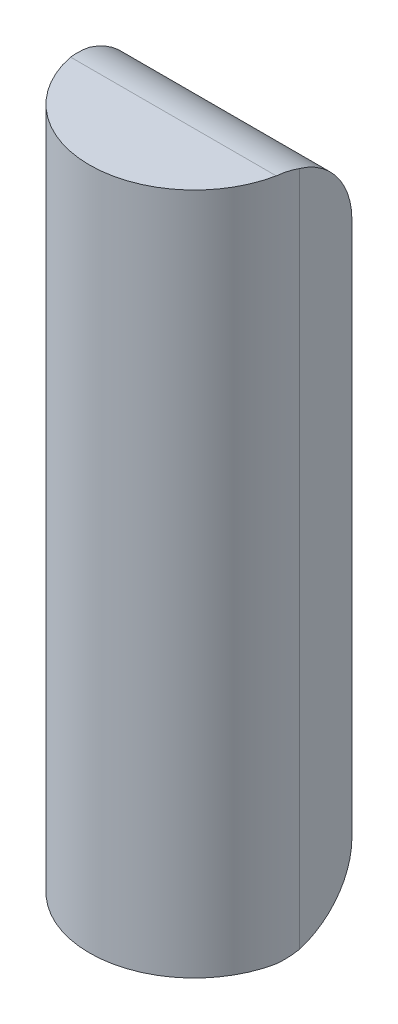
ISO-10303-21;
HEADER;
FILE_DESCRIPTION(('STEP AP214'),'2;1');
FILE_NAME('part.step','',(''),(''),'','','');
FILE_SCHEMA(('AUTOMOTIVE_DESIGN { 1 0 10303 214 1 1 1 1 }'));
ENDSEC;
DATA;
#1=APPLICATION_CONTEXT('core data for automotive mechanical design processes');
#2=APPLICATION_PROTOCOL_DEFINITION('international standard','automotive_design',2000,#1);
#3=PRODUCT_CONTEXT('',#1,'mechanical');
#4=PRODUCT('Part','Part','',(#3));
#5=PRODUCT_RELATED_PRODUCT_CATEGORY('part','',(#4));
#6=PRODUCT_DEFINITION_FORMATION('','',#4);
#7=PRODUCT_DEFINITION_CONTEXT('part definition',#1,'design');
#8=PRODUCT_DEFINITION('design','',#6,#7);
#9=PRODUCT_DEFINITION_SHAPE('','',#8);
#10=(LENGTH_UNIT() NAMED_UNIT(*) SI_UNIT(.MILLI.,.METRE.));
#11=(NAMED_UNIT(*) PLANE_ANGLE_UNIT() SI_UNIT($,.RADIAN.));
#12=(NAMED_UNIT(*) SI_UNIT($,.STERADIAN.) SOLID_ANGLE_UNIT());
#13=UNCERTAINTY_MEASURE_WITH_UNIT(LENGTH_MEASURE(1.E-05),#10,'distance_accuracy_value','');
#14=(GEOMETRIC_REPRESENTATION_CONTEXT(3) GLOBAL_UNCERTAINTY_ASSIGNED_CONTEXT((#13)) GLOBAL_UNIT_ASSIGNED_CONTEXT((#10,
#11,#12)) REPRESENTATION_CONTEXT('',''));
#15=CARTESIAN_POINT('',(0.,0.,0.));
#16=DIRECTION('',(0.,0.,1.));
#17=DIRECTION('',(1.,0.,0.));
#18=AXIS2_PLACEMENT_3D('',#15,#16,#17);
#19=CARTESIAN_POINT('',(0.2,0.,-0.35));
#20=DIRECTION('',(0.,1.,0.));
#21=DIRECTION('',(0.,0.,1.));
#22=AXIS2_PLACEMENT_3D('',#19,#20,#21);
#23=CYLINDRICAL_SURFACE('',#22,0.1);
#24=CARTESIAN_POINT('',(0.2,0.,-0.35));
#25=DIRECTION('',(0.,1.,0.));
#26=DIRECTION('',(0.,0.,1.));
#27=AXIS2_PLACEMENT_3D('',#24,#25,#26);
#28=CIRCLE('',#27,0.1);
#29=CARTESIAN_POINT('',(0.102020410288673,0.,-0.33));
#30=VERTEX_POINT('',#29);
#31=CARTESIAN_POINT('',(0.297979589711328,0.,-0.33));
#32=VERTEX_POINT('',#31);
#33=EDGE_CURVE('E11',#30,#32,#28,.T.);
#34=ORIENTED_EDGE('',*,*,#33,.T.);
#35=CARTESIAN_POINT('',(0.3,0.00291796067500543,-0.349999999999997));
#36=CARTESIAN_POINT('',(0.299915816237972,0.00267649394960228,-0.349190121189793));
#37=CARTESIAN_POINT('',(0.299831632475944,0.00244970743001091,-0.348375866058584));
#38=CARTESIAN_POINT('',(0.299663264951888,0.00202576163123392,-0.34673967912913));
#39=CARTESIAN_POINT('',(0.29957908118986,0.00182860235204831,-0.345917747330885));
#40=CARTESIAN_POINT('',(0.299410713665804,0.00146417786286507,-0.344267283042332));
#41=CARTESIAN_POINT('',(0.299326529903776,0.00129691265286744,-0.343438750552023));
#42=CARTESIAN_POINT('',(0.29915816237972,0.000992493455461802,-0.341776172212152));
#43=CARTESIAN_POINT('',(0.299073978617692,0.000855339468053788,-0.340942126362589));
#44=CARTESIAN_POINT('',(0.298905611093636,0.000611323369011899,-0.339269615138349));
#45=CARTESIAN_POINT('',(0.298821427331608,0.000504461257378025,-0.338431149763672));
#46=CARTESIAN_POINT('',(0.298653059807552,0.000321168311295574,-0.336750899341898));
#47=CARTESIAN_POINT('',(0.298568876045524,0.000244737476846995,-0.3359091142948));
#48=CARTESIAN_POINT('',(0.298400508521468,0.000122409650322964,-0.334223328579187));
#49=CARTESIAN_POINT('',(0.29831632475944,7.65126582475135E-05,-0.333379327910672));
#50=CARTESIAN_POINT('',(0.298147957235384,1.53042319068262E-05,-0.331690218311812));
#51=CARTESIAN_POINT('',(0.298063773473356,-7.20235841054829E-09,-0.330845109381467));
#52=CARTESIAN_POINT('',(0.297979589711328,0.,-0.33));
#53=B_SPLINE_CURVE_WITH_KNOTS('',3,(#35,#36,#37,#38,#39,#40,#41,#42,#43,#44,#45,#46,#47,#48,#49,
#50,#51,#52),.UNSPECIFIED.,.F.,.F.,(4,2,2,2,2,2,2,2,4),(0.,0.00254773712594258,
0.0050954742518852,0.00764321137782779,0.0101909485037704,0.012738685629713,0.0152864227556555,
0.0178341598815981,0.0203818970075407),.UNSPECIFIED.);
#54=CARTESIAN_POINT('',(0.3,0.00291796067500625,-0.35));
#55=VERTEX_POINT('',#54);
#56=EDGE_CURVE('E25',#55,#32,#53,.T.);
#57=ORIENTED_EDGE('',*,*,#56,.F.);
#58=DIRECTION('',(0.,1.,0.));
#59=VECTOR('',#58,1.);
#60=CARTESIAN_POINT('',(0.3,0.,-0.35));
#61=LINE('',#60,#59);
#62=CARTESIAN_POINT('',(0.3,0.647082039324994,-0.35));
#63=VERTEX_POINT('',#62);
#64=EDGE_CURVE('E73',#55,#63,#61,.T.);
#65=ORIENTED_EDGE('',*,*,#64,.T.);
#66=CARTESIAN_POINT('',(0.297979589711328,0.65,-0.33));
#67=CARTESIAN_POINT('',(0.298063773473356,0.650000007202358,-0.330845109381467));
#68=CARTESIAN_POINT('',(0.298147957235384,0.649984695768093,-0.331690218311812));
#69=CARTESIAN_POINT('',(0.29831632475944,0.649923487341753,-0.333379327910672));
#70=CARTESIAN_POINT('',(0.298400508521468,0.649877590349677,-0.334223328579187));
#71=CARTESIAN_POINT('',(0.298568876045524,0.649755262523153,-0.3359091142948));
#72=CARTESIAN_POINT('',(0.298653059807552,0.649678831688704,-0.336750899341898));
#73=CARTESIAN_POINT('',(0.298821427331608,0.649495538742622,-0.338431149763672));
#74=CARTESIAN_POINT('',(0.298905611093636,0.649388676630988,-0.339269615138349));
#75=CARTESIAN_POINT('',(0.299073978617692,0.649144660531946,-0.340942126362589));
#76=CARTESIAN_POINT('',(0.29915816237972,0.649007506544538,-0.341776172212152));
#77=CARTESIAN_POINT('',(0.299326529903776,0.648703087347132,-0.343438750552023));
#78=CARTESIAN_POINT('',(0.299410713665804,0.648535822137135,-0.344267283042332));
#79=CARTESIAN_POINT('',(0.29957908118986,0.648171397647952,-0.345917747330885));
#80=CARTESIAN_POINT('',(0.299663264951888,0.647974238368766,-0.34673967912913));
#81=CARTESIAN_POINT('',(0.299831632475944,0.647550292569989,-0.348375866058584));
#82=CARTESIAN_POINT('',(0.299915816237972,0.647323506050398,-0.349190121189793));
#83=CARTESIAN_POINT('',(0.3,0.647082039324995,-0.349999999999997));
#84=B_SPLINE_CURVE_WITH_KNOTS('',3,(#66,#67,#68,#69,#70,#71,#72,#73,#74,#75,#76,#77,#78,#79,#80,
#81,#82,#83),.UNSPECIFIED.,.F.,.F.,(4,2,2,2,2,2,2,2,4),(0.,0.0025477371259426,
0.00509547425188517,0.00764321137782782,0.0101909485037704,0.012738685629713,0.0152864227556557,
0.0178341598815982,0.0203818970075409),.UNSPECIFIED.);
#85=CARTESIAN_POINT('',(0.297979589711328,0.65,-0.33));
#86=VERTEX_POINT('',#85);
#87=EDGE_CURVE('E198',#86,#63,#84,.T.);
#88=ORIENTED_EDGE('',*,*,#87,.F.);
#89=CARTESIAN_POINT('',(0.2,0.65,-0.35));
#90=DIRECTION('',(0.,1.,0.));
#91=DIRECTION('',(0.,0.,1.));
#92=AXIS2_PLACEMENT_3D('',#89,#90,#91);
#93=CIRCLE('',#92,0.1);
#94=CARTESIAN_POINT('',(0.102020410288673,0.65,-0.33));
#95=VERTEX_POINT('',#94);
#96=EDGE_CURVE('E208',#95,#86,#93,.T.);
#97=ORIENTED_EDGE('',*,*,#96,.F.);
#98=CARTESIAN_POINT('',(0.1,0.647082039324995,-0.349999999999997));
#99=CARTESIAN_POINT('',(0.100084183762028,0.647323506050398,-0.349190121189793));
#100=CARTESIAN_POINT('',(0.100168367524056,0.647550292569989,-0.348375866058584));
#101=CARTESIAN_POINT('',(0.100336735048112,0.647974238368766,-0.34673967912913));
#102=CARTESIAN_POINT('',(0.10042091881014,0.648171397647952,-0.345917747330885));
#103=CARTESIAN_POINT('',(0.100589286334196,0.648535822137135,-0.344267283042332));
#104=CARTESIAN_POINT('',(0.100673470096224,0.648703087347132,-0.343438750552023));
#105=CARTESIAN_POINT('',(0.10084183762028,0.649007506544538,-0.341776172212152));
#106=CARTESIAN_POINT('',(0.100926021382308,0.649144660531946,-0.340942126362589));
#107=CARTESIAN_POINT('',(0.101094388906365,0.649388676630988,-0.339269615138349));
#108=CARTESIAN_POINT('',(0.101178572668393,0.649495538742622,-0.338431149763672));
#109=CARTESIAN_POINT('',(0.101346940192449,0.649678831688704,-0.336750899341898));
#110=CARTESIAN_POINT('',(0.101431123954477,0.649755262523153,-0.3359091142948));
#111=CARTESIAN_POINT('',(0.101599491478533,0.649877590349677,-0.334223328579187));
#112=CARTESIAN_POINT('',(0.101683675240561,0.649923487341753,-0.333379327910672));
#113=CARTESIAN_POINT('',(0.101852042764617,0.649984695768093,-0.331690218311812));
#114=CARTESIAN_POINT('',(0.101936226526645,0.650000007202358,-0.330845109381467));
#115=CARTESIAN_POINT('',(0.102020410288673,0.65,-0.33));
#116=B_SPLINE_CURVE_WITH_KNOTS('',3,(#98,#99,#100,#101,#102,#103,#104,#105,#106,#107,#108,#109,
#110,#111,#112,#113,#114,#115),.UNSPECIFIED.,.F.,.F.,(4,2,2,2,2,2,2,2,4),(0.,0.0025477371259426,
0.0050954742518852,0.0076432113778277,0.0101909485037703,0.0127386856297129,0.0152864227556554,
0.0178341598815981,0.0203818970075407),.UNSPECIFIED.);
#117=CARTESIAN_POINT('',(0.1,0.647082039324994,-0.35));
#118=VERTEX_POINT('',#117);
#119=EDGE_CURVE('E210',#118,#95,#116,.T.);
#120=ORIENTED_EDGE('',*,*,#119,.F.);
#121=DIRECTION('',(0.,1.,0.));
#122=VECTOR('',#121,1.);
#123=CARTESIAN_POINT('',(0.1,0.,-0.35));
#124=LINE('',#123,#122);
#125=CARTESIAN_POINT('',(0.0999999999999997,0.0029179606750054,-0.349999999999999));
#126=VERTEX_POINT('',#125);
#127=EDGE_CURVE('E214',#126,#118,#124,.T.);
#128=ORIENTED_EDGE('',*,*,#127,.F.);
#129=CARTESIAN_POINT('',(0.102020410288673,0.,-0.33));
#130=CARTESIAN_POINT('',(0.101936226526645,-7.20235841423512E-09,-0.330845109381467));
#131=CARTESIAN_POINT('',(0.101852042764617,1.53042319068252E-05,-0.331690218311812));
#132=CARTESIAN_POINT('',(0.101683675240561,7.65126582475138E-05,-0.333379327910672));
#133=CARTESIAN_POINT('',(0.101599491478533,0.000122409650322963,-0.334223328579187));
#134=CARTESIAN_POINT('',(0.101431123954477,0.000244737476846975,-0.335909114294799));
#135=CARTESIAN_POINT('',(0.101346940192449,0.000321168311295538,-0.336750899341897));
#136=CARTESIAN_POINT('',(0.101178572668393,0.000504461257377977,-0.338431149763672));
#137=CARTESIAN_POINT('',(0.101094388906365,0.000611323369011852,-0.339269615138349));
#138=CARTESIAN_POINT('',(0.100926021382308,0.000855339468053721,-0.340942126362589));
#139=CARTESIAN_POINT('',(0.10084183762028,0.000992493455461713,-0.341776172212152));
#140=CARTESIAN_POINT('',(0.100673470096224,0.00129691265286732,-0.343438750552023));
#141=CARTESIAN_POINT('',(0.100589286334196,0.00146417786286494,-0.344267283042331));
#142=CARTESIAN_POINT('',(0.10042091881014,0.00182860235204814,-0.345917747330884));
#143=CARTESIAN_POINT('',(0.100336735048112,0.00202576163123373,-0.346739679129129));
#144=CARTESIAN_POINT('',(0.100168367524056,0.00244970743001067,-0.348375866058583));
#145=CARTESIAN_POINT('',(0.100084183762028,0.00267649394960202,-0.349190121189792));
#146=CARTESIAN_POINT('',(0.1,0.00291796067500515,-0.349999999999996));
#147=B_SPLINE_CURVE_WITH_KNOTS('',3,(#129,#130,#131,#132,#133,#134,#135,#136,#137,#138,#139,
#140,#141,#142,#143,#144,#145,#146),.UNSPECIFIED.,.F.,.F.,(4,2,2,2,2,2,2,2,4),(0.,
0.00254773712594245,0.00509547425188487,0.00764321137782737,0.0101909485037699,
0.0127386856297124,0.0152864227556549,0.0178341598815973,0.0203818970075397),.UNSPECIFIED.);
#148=EDGE_CURVE('E117',#30,#126,#147,.T.);
#149=ORIENTED_EDGE('',*,*,#148,.F.);
#150=EDGE_LOOP('',(#34,#57,#65,#88,#97,#120,#128,#149));
#151=FACE_BOUND('',#150,.T.);
#152=ADVANCED_FACE('F17',(#151),#23,.T.);
#153=CARTESIAN_POINT('',(0.1,0.,-0.4));
#154=DIRECTION('',(-1.,0.,0.));
#155=DIRECTION('',(0.,0.,1.));
#156=AXIS2_PLACEMENT_3D('',#153,#154,#155);
#157=PLANE('',#156);
#158=CARTESIAN_POINT('',(0.1,0.58,-0.33));
#159=DIRECTION('',(1.,0.,0.));
#160=DIRECTION('',(0.,0.,1.));
#161=AXIS2_PLACEMENT_3D('',#158,#159,#160);
#162=CIRCLE('',#161,0.07);
#163=CARTESIAN_POINT('',(0.1,0.58,-0.4));
#164=VERTEX_POINT('',#163);
#165=EDGE_CURVE('E112',#164,#118,#162,.T.);
#166=ORIENTED_EDGE('',*,*,#165,.F.);
#167=DIRECTION('',(0.,1.,0.));
#168=VECTOR('',#167,1.);
#169=CARTESIAN_POINT('',(0.1,0.,-0.4));
#170=LINE('',#169,#168);
#171=CARTESIAN_POINT('',(0.1,0.07,-0.4));
#172=VERTEX_POINT('',#171);
#173=EDGE_CURVE('E110',#172,#164,#170,.T.);
#174=ORIENTED_EDGE('',*,*,#173,.F.);
#175=CARTESIAN_POINT('',(0.1,0.07,-0.33));
#176=DIRECTION('',(1.,0.,0.));
#177=DIRECTION('',(0.,0.,1.));
#178=AXIS2_PLACEMENT_3D('',#175,#176,#177);
#179=CIRCLE('',#178,0.07);
#180=EDGE_CURVE('E90',#126,#172,#179,.T.);
#181=ORIENTED_EDGE('',*,*,#180,.F.);
#182=ORIENTED_EDGE('',*,*,#127,.T.);
#183=EDGE_LOOP('',(#166,#174,#181,#182));
#184=FACE_BOUND('',#183,.T.);
#185=ADVANCED_FACE('F165',(#184),#157,.T.);
#186=CARTESIAN_POINT('',(0.3,0.,-0.35));
#187=DIRECTION('',(1.,0.,0.));
#188=DIRECTION('',(0.,0.,-1.));
#189=AXIS2_PLACEMENT_3D('',#186,#187,#188);
#190=PLANE('',#189);
#191=CARTESIAN_POINT('',(0.300000000000001,0.58,-0.33));
#192=DIRECTION('',(-1.,0.,0.));
#193=DIRECTION('',(0.,0.,-1.));
#194=AXIS2_PLACEMENT_3D('',#191,#192,#193);
#195=CIRCLE('',#194,0.07);
#196=CARTESIAN_POINT('',(0.3,0.58,-0.4));
#197=VERTEX_POINT('',#196);
#198=EDGE_CURVE('E76',#63,#197,#195,.T.);
#199=ORIENTED_EDGE('',*,*,#198,.F.);
#200=ORIENTED_EDGE('',*,*,#64,.F.);
#201=CARTESIAN_POINT('',(0.300000000000001,0.07,-0.33));
#202=DIRECTION('',(-1.,0.,0.));
#203=DIRECTION('',(0.,0.,-1.));
#204=AXIS2_PLACEMENT_3D('',#201,#202,#203);
#205=CIRCLE('',#204,0.07);
#206=CARTESIAN_POINT('',(0.3,0.07,-0.4));
#207=VERTEX_POINT('',#206);
#208=EDGE_CURVE('E67',#207,#55,#205,.T.);
#209=ORIENTED_EDGE('',*,*,#208,.F.);
#210=DIRECTION('',(0.,1.,0.));
#211=VECTOR('',#210,1.);
#212=CARTESIAN_POINT('',(0.3,0.,-0.4));
#213=LINE('',#212,#211);
#214=EDGE_CURVE('E71',#207,#197,#213,.T.);
#215=ORIENTED_EDGE('',*,*,#214,.T.);
#216=EDGE_LOOP('',(#199,#200,#209,#215));
#217=FACE_BOUND('',#216,.T.);
#218=ADVANCED_FACE('F70',(#217),#190,.T.);
#219=CARTESIAN_POINT('',(0.,0.58,-0.33));
#220=DIRECTION('',(1.,0.,0.));
#221=DIRECTION('',(0.,0.,-1.));
#222=AXIS2_PLACEMENT_3D('',#219,#220,#221);
#223=CYLINDRICAL_SURFACE('',#222,0.07);
#224=DIRECTION('',(1.,0.,0.));
#225=VECTOR('',#224,1.);
#226=CARTESIAN_POINT('',(0.8,0.58,-0.4));
#227=LINE('',#226,#225);
#228=EDGE_CURVE('E84',#164,#197,#227,.T.);
#229=ORIENTED_EDGE('',*,*,#228,.F.);
#230=ORIENTED_EDGE('',*,*,#165,.T.);
#231=ORIENTED_EDGE('',*,*,#119,.T.);
#232=DIRECTION('',(-1.,0.,0.));
#233=VECTOR('',#232,1.);
#234=CARTESIAN_POINT('',(-0.8,0.65,-0.33));
#235=LINE('',#234,#233);
#236=EDGE_CURVE('E91',#86,#95,#235,.T.);
#237=ORIENTED_EDGE('',*,*,#236,.F.);
#238=ORIENTED_EDGE('',*,*,#87,.T.);
#239=ORIENTED_EDGE('',*,*,#198,.T.);
#240=EDGE_LOOP('',(#229,#230,#231,#237,#238,#239));
#241=FACE_BOUND('',#240,.T.);
#242=ADVANCED_FACE('F173',(#241),#223,.T.);
#243=CARTESIAN_POINT('',(0.,0.65,0.));
#244=DIRECTION('',(0.,1.,0.));
#245=DIRECTION('',(0.,0.,1.));
#246=AXIS2_PLACEMENT_3D('',#243,#244,#245);
#247=PLANE('',#246);
#248=ORIENTED_EDGE('',*,*,#236,.T.);
#249=ORIENTED_EDGE('',*,*,#96,.T.);
#250=EDGE_LOOP('',(#248,#249));
#251=FACE_BOUND('',#250,.T.);
#252=ADVANCED_FACE('F143',(#251),#247,.T.);
#253=CARTESIAN_POINT('',(0.8,0.07,-0.33));
#254=DIRECTION('',(-1.,0.,0.));
#255=DIRECTION('',(0.,0.,1.));
#256=AXIS2_PLACEMENT_3D('',#253,#254,#255);
#257=CYLINDRICAL_SURFACE('',#256,0.07);
#258=ORIENTED_EDGE('',*,*,#148,.T.);
#259=ORIENTED_EDGE('',*,*,#180,.T.);
#260=DIRECTION('',(-1.,0.,0.));
#261=VECTOR('',#260,1.);
#262=CARTESIAN_POINT('',(0.8,0.07,-0.4));
#263=LINE('',#262,#261);
#264=EDGE_CURVE('E82',#207,#172,#263,.T.);
#265=ORIENTED_EDGE('',*,*,#264,.F.);
#266=ORIENTED_EDGE('',*,*,#208,.T.);
#267=ORIENTED_EDGE('',*,*,#56,.T.);
#268=DIRECTION('',(1.,0.,0.));
#269=VECTOR('',#268,1.);
#270=CARTESIAN_POINT('',(0.,0.,-0.33));
#271=LINE('',#270,#269);
#272=EDGE_CURVE('E92',#30,#32,#271,.T.);
#273=ORIENTED_EDGE('',*,*,#272,.F.);
#274=EDGE_LOOP('',(#258,#259,#265,#266,#267,#273));
#275=FACE_BOUND('',#274,.T.);
#276=ADVANCED_FACE('F88',(#275),#257,.T.);
#277=CARTESIAN_POINT('',(0.,0.,0.));
#278=DIRECTION('',(0.,1.,0.));
#279=DIRECTION('',(0.,0.,1.));
#280=AXIS2_PLACEMENT_3D('',#277,#278,#279);
#281=PLANE('',#280);
#282=ORIENTED_EDGE('',*,*,#33,.F.);
#283=ORIENTED_EDGE('',*,*,#272,.T.);
#284=EDGE_LOOP('',(#282,#283));
#285=FACE_BOUND('',#284,.T.);
#286=ADVANCED_FACE('F142',(#285),#281,.F.);
#287=CARTESIAN_POINT('',(0.8,0.65,-0.4));
#288=DIRECTION('',(0.,0.,1.));
#289=DIRECTION('',(1.,0.,0.));
#290=AXIS2_PLACEMENT_3D('',#287,#288,#289);
#291=PLANE('',#290);
#292=ORIENTED_EDGE('',*,*,#214,.F.);
#293=ORIENTED_EDGE('',*,*,#264,.T.);
#294=ORIENTED_EDGE('',*,*,#173,.T.);
#295=ORIENTED_EDGE('',*,*,#228,.T.);
#296=EDGE_LOOP('',(#292,#293,#294,#295));
#297=FACE_BOUND('',#296,.T.);
#298=ADVANCED_FACE('F80',(#297),#291,.F.);
#299=CLOSED_SHELL('',(#152,#185,#218,#242,#252,#276,#286,#298));
#300=MANIFOLD_SOLID_BREP('B1',#299);
#301=ADVANCED_BREP_SHAPE_REPRESENTATION('',(#18,#300),#14);
#302=SHAPE_DEFINITION_REPRESENTATION(#9,#301);
ENDSEC;
END-ISO-10303-21;
